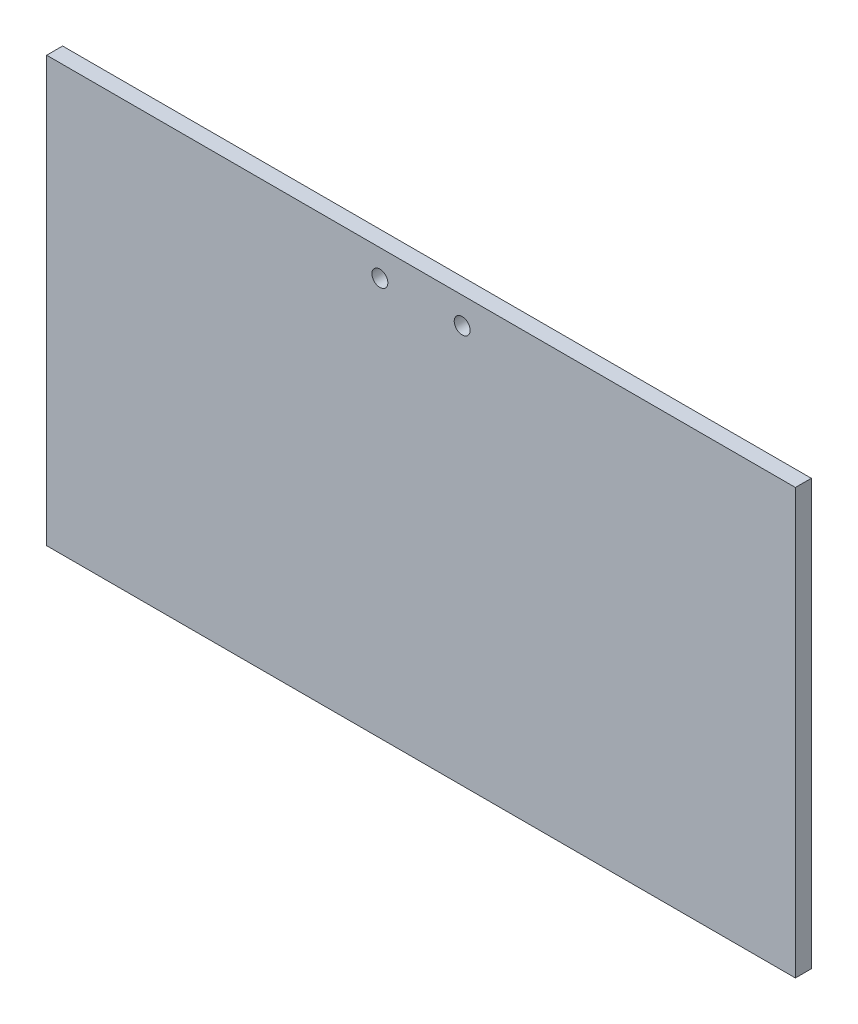
ISO-10303-21;
HEADER;
FILE_DESCRIPTION(('STEP AP214'),'2;1');
FILE_NAME('part.step','',(''),(''),'','','');
FILE_SCHEMA(('AUTOMOTIVE_DESIGN { 1 0 10303 214 1 1 1 1 }'));
ENDSEC;
DATA;
#1=APPLICATION_CONTEXT('core data for automotive mechanical design processes');
#2=APPLICATION_PROTOCOL_DEFINITION('international standard','automotive_design',2000,#1);
#3=PRODUCT_CONTEXT('',#1,'mechanical');
#4=PRODUCT('Part','Part','',(#3));
#5=PRODUCT_RELATED_PRODUCT_CATEGORY('part','',(#4));
#6=PRODUCT_DEFINITION_FORMATION('','',#4);
#7=PRODUCT_DEFINITION_CONTEXT('part definition',#1,'design');
#8=PRODUCT_DEFINITION('design','',#6,#7);
#9=PRODUCT_DEFINITION_SHAPE('','',#8);
#10=(LENGTH_UNIT() NAMED_UNIT(*) SI_UNIT(.MILLI.,.METRE.));
#11=(NAMED_UNIT(*) PLANE_ANGLE_UNIT() SI_UNIT($,.RADIAN.));
#12=(NAMED_UNIT(*) SI_UNIT($,.STERADIAN.) SOLID_ANGLE_UNIT());
#13=UNCERTAINTY_MEASURE_WITH_UNIT(LENGTH_MEASURE(1.E-05),#10,'distance_accuracy_value','');
#14=(GEOMETRIC_REPRESENTATION_CONTEXT(3) GLOBAL_UNCERTAINTY_ASSIGNED_CONTEXT((#13)) GLOBAL_UNIT_ASSIGNED_CONTEXT((#10,
#11,#12)) REPRESENTATION_CONTEXT('',''));
#15=CARTESIAN_POINT('',(0.,0.,0.));
#16=DIRECTION('',(0.,0.,1.));
#17=DIRECTION('',(1.,0.,0.));
#18=AXIS2_PLACEMENT_3D('',#15,#16,#17);
#19=CARTESIAN_POINT('',(-39.9942446043166,37.4100719424461,-3.));
#20=DIRECTION('',(-1.,0.,0.));
#21=DIRECTION('',(0.,0.,1.));
#22=AXIS2_PLACEMENT_3D('',#19,#20,#21);
#23=PLANE('',#22);
#24=DIRECTION('',(0.,-1.,0.));
#25=VECTOR('',#24,1.);
#26=CARTESIAN_POINT('',(-39.9942446043166,37.4100719424461,0.));
#27=LINE('',#26,#25);
#28=CARTESIAN_POINT('',(-39.9942446043166,37.4100719424461,0.));
#29=VERTEX_POINT('',#28);
#30=CARTESIAN_POINT('',(-39.9942446043166,-42.589928057554,0.));
#31=VERTEX_POINT('',#30);
#32=EDGE_CURVE('E98',#29,#31,#27,.T.);
#33=ORIENTED_EDGE('',*,*,#32,.F.);
#34=DIRECTION('',(0.,0.,1.));
#35=VECTOR('',#34,1.);
#36=CARTESIAN_POINT('',(-39.9942446043166,37.4100719424461,-3.));
#37=LINE('',#36,#35);
#38=CARTESIAN_POINT('',(-39.9942446043166,37.4100719424461,-3.));
#39=VERTEX_POINT('',#38);
#40=EDGE_CURVE('E11',#39,#29,#37,.T.);
#41=ORIENTED_EDGE('',*,*,#40,.F.);
#42=DIRECTION('',(0.,-1.,0.));
#43=VECTOR('',#42,1.);
#44=CARTESIAN_POINT('',(-39.9942446043166,37.4100719424461,-3.));
#45=LINE('',#44,#43);
#46=CARTESIAN_POINT('',(-39.9942446043166,-42.589928057554,-3.));
#47=VERTEX_POINT('',#46);
#48=EDGE_CURVE('E91',#39,#47,#45,.T.);
#49=ORIENTED_EDGE('',*,*,#48,.T.);
#50=DIRECTION('',(0.,0.,1.));
#51=VECTOR('',#50,1.);
#52=CARTESIAN_POINT('',(-39.9942446043166,-42.589928057554,-3.));
#53=LINE('',#52,#51);
#54=EDGE_CURVE('E36',#47,#31,#53,.T.);
#55=ORIENTED_EDGE('',*,*,#54,.T.);
#56=EDGE_LOOP('',(#33,#41,#49,#55));
#57=FACE_BOUND('',#56,.T.);
#58=ADVANCED_FACE('F33',(#57),#23,.T.);
#59=CARTESIAN_POINT('',(-39.9942446043166,37.4100719424461,-3.));
#60=DIRECTION('',(0.,1.,0.));
#61=DIRECTION('',(0.,0.,1.));
#62=AXIS2_PLACEMENT_3D('',#59,#60,#61);
#63=PLANE('',#62);
#64=DIRECTION('',(-1.,0.,0.));
#65=VECTOR('',#64,1.);
#66=CARTESIAN_POINT('',(-39.9942446043166,37.4100719424461,0.));
#67=LINE('',#66,#65);
#68=CARTESIAN_POINT('',(101.005755395683,37.4100719424461,0.));
#69=VERTEX_POINT('',#68);
#70=EDGE_CURVE('E93',#69,#29,#67,.T.);
#71=ORIENTED_EDGE('',*,*,#70,.F.);
#72=DIRECTION('',(0.,0.,1.));
#73=VECTOR('',#72,1.);
#74=CARTESIAN_POINT('',(101.005755395683,37.4100719424461,-3.));
#75=LINE('',#74,#73);
#76=CARTESIAN_POINT('',(101.005755395683,37.4100719424461,-3.));
#77=VERTEX_POINT('',#76);
#78=EDGE_CURVE('E42',#77,#69,#75,.T.);
#79=ORIENTED_EDGE('',*,*,#78,.F.);
#80=DIRECTION('',(-1.,0.,0.));
#81=VECTOR('',#80,1.);
#82=CARTESIAN_POINT('',(-39.9942446043166,37.4100719424461,-3.));
#83=LINE('',#82,#81);
#84=EDGE_CURVE('E88',#77,#39,#83,.T.);
#85=ORIENTED_EDGE('',*,*,#84,.T.);
#86=ORIENTED_EDGE('',*,*,#40,.T.);
#87=EDGE_LOOP('',(#71,#79,#85,#86));
#88=FACE_BOUND('',#87,.T.);
#89=ADVANCED_FACE('F109',(#88),#63,.T.);
#90=CARTESIAN_POINT('',(101.005755395683,37.4100719424461,-3.));
#91=DIRECTION('',(1.,0.,0.));
#92=DIRECTION('',(0.,0.,-1.));
#93=AXIS2_PLACEMENT_3D('',#90,#91,#92);
#94=PLANE('',#93);
#95=DIRECTION('',(0.,1.,0.));
#96=VECTOR('',#95,1.);
#97=CARTESIAN_POINT('',(101.005755395683,37.4100719424461,0.));
#98=LINE('',#97,#96);
#99=CARTESIAN_POINT('',(101.005755395683,-42.5899280575539,0.));
#100=VERTEX_POINT('',#99);
#101=EDGE_CURVE('E83',#100,#69,#98,.T.);
#102=ORIENTED_EDGE('',*,*,#101,.F.);
#103=DIRECTION('',(0.,0.,1.));
#104=VECTOR('',#103,1.);
#105=CARTESIAN_POINT('',(101.005755395683,-42.5899280575539,-3.));
#106=LINE('',#105,#104);
#107=CARTESIAN_POINT('',(101.005755395683,-42.5899280575539,-3.));
#108=VERTEX_POINT('',#107);
#109=EDGE_CURVE('E78',#108,#100,#106,.T.);
#110=ORIENTED_EDGE('',*,*,#109,.F.);
#111=DIRECTION('',(0.,1.,0.));
#112=VECTOR('',#111,1.);
#113=CARTESIAN_POINT('',(101.005755395683,37.4100719424461,-3.));
#114=LINE('',#113,#112);
#115=EDGE_CURVE('E81',#108,#77,#114,.T.);
#116=ORIENTED_EDGE('',*,*,#115,.T.);
#117=ORIENTED_EDGE('',*,*,#78,.T.);
#118=EDGE_LOOP('',(#102,#110,#116,#117));
#119=FACE_BOUND('',#118,.T.);
#120=ADVANCED_FACE('F80',(#119),#94,.T.);
#121=CARTESIAN_POINT('',(-39.9942446043166,-42.589928057554,-3.));
#122=DIRECTION('',(0.,-1.,0.));
#123=DIRECTION('',(1.,0.,0.));
#124=AXIS2_PLACEMENT_3D('',#121,#122,#123);
#125=PLANE('',#124);
#126=DIRECTION('',(1.,0.,0.));
#127=VECTOR('',#126,1.);
#128=CARTESIAN_POINT('',(-39.9942446043166,-42.589928057554,0.));
#129=LINE('',#128,#127);
#130=EDGE_CURVE('E101',#31,#100,#129,.T.);
#131=ORIENTED_EDGE('',*,*,#130,.F.);
#132=ORIENTED_EDGE('',*,*,#54,.F.);
#133=DIRECTION('',(1.,0.,0.));
#134=VECTOR('',#133,1.);
#135=CARTESIAN_POINT('',(-39.9942446043166,-42.589928057554,-3.));
#136=LINE('',#135,#134);
#137=EDGE_CURVE('E87',#47,#108,#136,.T.);
#138=ORIENTED_EDGE('',*,*,#137,.T.);
#139=ORIENTED_EDGE('',*,*,#109,.T.);
#140=EDGE_LOOP('',(#131,#132,#138,#139));
#141=FACE_BOUND('',#140,.T.);
#142=ADVANCED_FACE('F90',(#141),#125,.T.);
#143=CARTESIAN_POINT('',(0.,0.,-3.));
#144=DIRECTION('',(0.,0.,1.));
#145=DIRECTION('',(1.,0.,0.));
#146=AXIS2_PLACEMENT_3D('',#143,#144,#145);
#147=PLANE('',#146);
#148=CARTESIAN_POINT('',(38.2557553956834,32.4100719424461,-3.));
#149=DIRECTION('',(0.,0.,1.));
#150=DIRECTION('',(1.,0.,0.));
#151=AXIS2_PLACEMENT_3D('',#148,#149,#150);
#152=CIRCLE('',#151,1.5);
#153=CARTESIAN_POINT('',(39.7557553956834,32.4100719424461,-3.));
#154=VERTEX_POINT('',#153);
#155=EDGE_CURVE('E142',#154,#154,#152,.T.);
#156=ORIENTED_EDGE('',*,*,#155,.T.);
#157=EDGE_LOOP('',(#156));
#158=FACE_BOUND('',#157,.T.);
#159=CARTESIAN_POINT('',(22.7557553956834,32.4100719424461,-3.));
#160=DIRECTION('',(0.,0.,1.));
#161=DIRECTION('',(1.,0.,0.));
#162=AXIS2_PLACEMENT_3D('',#159,#160,#161);
#163=CIRCLE('',#162,1.5);
#164=CARTESIAN_POINT('',(24.2557553956834,32.4100719424461,-3.));
#165=VERTEX_POINT('',#164);
#166=EDGE_CURVE('E102',#165,#165,#163,.T.);
#167=ORIENTED_EDGE('',*,*,#166,.T.);
#168=EDGE_LOOP('',(#167));
#169=FACE_BOUND('',#168,.T.);
#170=ORIENTED_EDGE('',*,*,#48,.F.);
#171=ORIENTED_EDGE('',*,*,#84,.F.);
#172=ORIENTED_EDGE('',*,*,#115,.F.);
#173=ORIENTED_EDGE('',*,*,#137,.F.);
#174=EDGE_LOOP('',(#170,#171,#172,#173));
#175=FACE_BOUND('',#174,.T.);
#176=ADVANCED_FACE('F86',(#158,#169,#175),#147,.F.);
#177=CARTESIAN_POINT('',(0.,0.,0.));
#178=DIRECTION('',(0.,0.,1.));
#179=DIRECTION('',(1.,0.,0.));
#180=AXIS2_PLACEMENT_3D('',#177,#178,#179);
#181=PLANE('',#180);
#182=CARTESIAN_POINT('',(38.2557553956834,32.4100719424461,0.));
#183=DIRECTION('',(0.,0.,1.));
#184=DIRECTION('',(1.,0.,0.));
#185=AXIS2_PLACEMENT_3D('',#182,#183,#184);
#186=CIRCLE('',#185,1.5);
#187=CARTESIAN_POINT('',(39.7557553956834,32.4100719424461,0.));
#188=VERTEX_POINT('',#187);
#189=EDGE_CURVE('E145',#188,#188,#186,.T.);
#190=ORIENTED_EDGE('',*,*,#189,.F.);
#191=EDGE_LOOP('',(#190));
#192=FACE_BOUND('',#191,.T.);
#193=CARTESIAN_POINT('',(22.7557553956834,32.4100719424461,0.));
#194=DIRECTION('',(0.,0.,1.));
#195=DIRECTION('',(1.,0.,0.));
#196=AXIS2_PLACEMENT_3D('',#193,#194,#195);
#197=CIRCLE('',#196,1.5);
#198=CARTESIAN_POINT('',(24.2557553956834,32.4100719424461,0.));
#199=VERTEX_POINT('',#198);
#200=EDGE_CURVE('E147',#199,#199,#197,.T.);
#201=ORIENTED_EDGE('',*,*,#200,.F.);
#202=EDGE_LOOP('',(#201));
#203=FACE_BOUND('',#202,.T.);
#204=ORIENTED_EDGE('',*,*,#32,.T.);
#205=ORIENTED_EDGE('',*,*,#130,.T.);
#206=ORIENTED_EDGE('',*,*,#101,.T.);
#207=ORIENTED_EDGE('',*,*,#70,.T.);
#208=EDGE_LOOP('',(#204,#205,#206,#207));
#209=FACE_BOUND('',#208,.T.);
#210=ADVANCED_FACE('F108',(#192,#203,#209),#181,.T.);
#211=CARTESIAN_POINT('',(22.7557553956834,32.4100719424461,-3.));
#212=DIRECTION('',(0.,0.,1.));
#213=DIRECTION('',(1.,0.,0.));
#214=AXIS2_PLACEMENT_3D('',#211,#212,#213);
#215=CYLINDRICAL_SURFACE('',#214,1.5);
#216=ORIENTED_EDGE('',*,*,#166,.F.);
#217=EDGE_LOOP('',(#216));
#218=FACE_BOUND('',#217,.T.);
#219=ORIENTED_EDGE('',*,*,#200,.T.);
#220=EDGE_LOOP('',(#219));
#221=FACE_BOUND('',#220,.T.);
#222=ADVANCED_FACE('F127',(#218,#221),#215,.F.);
#223=CARTESIAN_POINT('',(38.2557553956834,32.4100719424461,-3.));
#224=DIRECTION('',(0.,0.,1.));
#225=DIRECTION('',(1.,0.,0.));
#226=AXIS2_PLACEMENT_3D('',#223,#224,#225);
#227=CYLINDRICAL_SURFACE('',#226,1.5);
#228=ORIENTED_EDGE('',*,*,#155,.F.);
#229=EDGE_LOOP('',(#228));
#230=FACE_BOUND('',#229,.T.);
#231=ORIENTED_EDGE('',*,*,#189,.T.);
#232=EDGE_LOOP('',(#231));
#233=FACE_BOUND('',#232,.T.);
#234=ADVANCED_FACE('F134',(#230,#233),#227,.F.);
#235=CLOSED_SHELL('',(#58,#89,#120,#142,#176,#210,#222,#234));
#236=MANIFOLD_SOLID_BREP('B2',#235);
#237=ADVANCED_BREP_SHAPE_REPRESENTATION('',(#18,#236),#14);
#238=SHAPE_DEFINITION_REPRESENTATION(#9,#237);
ENDSEC;
END-ISO-10303-21;
